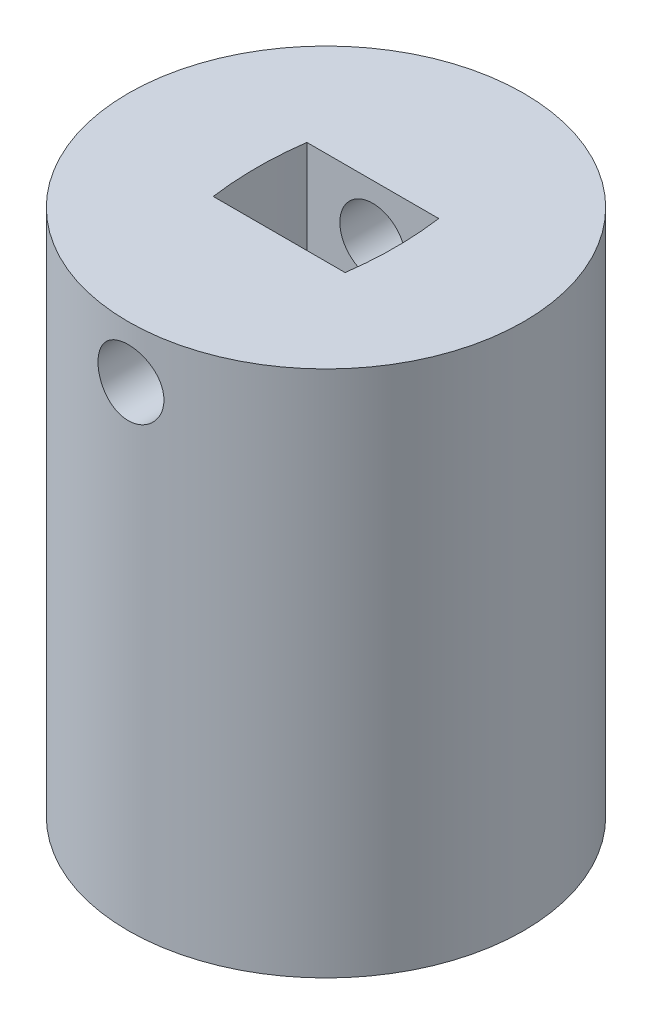
ISO-10303-21;
HEADER;
FILE_DESCRIPTION(('STEP AP214'),'2;1');
FILE_NAME('part.step','',(''),(''),'','','');
FILE_SCHEMA(('AUTOMOTIVE_DESIGN { 1 0 10303 214 1 1 1 1 }'));
ENDSEC;
DATA;
#1=APPLICATION_CONTEXT('core data for automotive mechanical design processes');
#2=APPLICATION_PROTOCOL_DEFINITION('international standard','automotive_design',2000,#1);
#3=PRODUCT_CONTEXT('',#1,'mechanical');
#4=PRODUCT('Part','Part','',(#3));
#5=PRODUCT_RELATED_PRODUCT_CATEGORY('part','',(#4));
#6=PRODUCT_DEFINITION_FORMATION('','',#4);
#7=PRODUCT_DEFINITION_CONTEXT('part definition',#1,'design');
#8=PRODUCT_DEFINITION('design','',#6,#7);
#9=PRODUCT_DEFINITION_SHAPE('','',#8);
#10=(LENGTH_UNIT() NAMED_UNIT(*) SI_UNIT(.MILLI.,.METRE.));
#11=(NAMED_UNIT(*) PLANE_ANGLE_UNIT() SI_UNIT($,.RADIAN.));
#12=(NAMED_UNIT(*) SI_UNIT($,.STERADIAN.) SOLID_ANGLE_UNIT());
#13=UNCERTAINTY_MEASURE_WITH_UNIT(LENGTH_MEASURE(1.E-05),#10,'distance_accuracy_value','');
#14=(GEOMETRIC_REPRESENTATION_CONTEXT(3) GLOBAL_UNCERTAINTY_ASSIGNED_CONTEXT((#13)) GLOBAL_UNIT_ASSIGNED_CONTEXT((#10,
#11,#12)) REPRESENTATION_CONTEXT('',''));
#15=CARTESIAN_POINT('',(0.,0.,0.));
#16=DIRECTION('',(0.,0.,1.));
#17=DIRECTION('',(1.,0.,0.));
#18=AXIS2_PLACEMENT_3D('',#15,#16,#17);
#19=CARTESIAN_POINT('',(0.,40.,0.));
#20=DIRECTION('',(0.,-1.,0.));
#21=DIRECTION('',(0.,0.,-1.));
#22=AXIS2_PLACEMENT_3D('',#19,#20,#21);
#23=CYLINDRICAL_SURFACE('',#22,15.);
#24=CARTESIAN_POINT('',(0.,33.5,15.));
#25=CARTESIAN_POINT('',(-0.139390904958215,33.5000055889478,14.9999976116882));
#26=CARTESIAN_POINT('',(-0.278857881838821,33.5116972749689,14.9980367791303));
#27=CARTESIAN_POINT('',(-0.553880221673043,33.5581356587653,14.9904034494139));
#28=CARTESIAN_POINT('',(-0.689431867959247,33.5929035569116,14.9847275392389));
#29=CARTESIAN_POINT('',(-0.952604747212645,33.6844154485928,14.9703006823645));
#30=CARTESIAN_POINT('',(-1.0802323684319,33.7411414656406,14.9615522515919));
#31=CARTESIAN_POINT('',(-1.32414184197795,33.8749122920524,14.9419422708207));
#32=CARTESIAN_POINT('',(-1.44042498987859,33.951954777483,14.9310809625443));
#33=CARTESIAN_POINT('',(-1.65947261429168,34.1249550838205,14.9083331745831));
#34=CARTESIAN_POINT('',(-1.76211290353497,34.2210691146361,14.8964387181486));
#35=CARTESIAN_POINT('',(-1.94988849865993,34.4291479684728,14.8730262687673));
#36=CARTESIAN_POINT('',(-2.03502269939097,34.5411137914566,14.8615082996267));
#37=CARTESIAN_POINT('',(-2.18586712560513,34.7785709661971,14.8400756575978));
#38=CARTESIAN_POINT('',(-2.251454552861,34.9041413368047,14.8301712909164));
#39=CARTESIAN_POINT('',(-2.36055836541122,35.1647095643006,14.8131978979467));
#40=CARTESIAN_POINT('',(-2.40407624156561,35.2997067836776,14.8061286801431));
#41=CARTESIAN_POINT('',(-2.46741437778481,35.5739802748565,14.7957053684276));
#42=CARTESIAN_POINT('',(-2.4874490291354,35.7132057365014,14.792317684857));
#43=CARTESIAN_POINT('',(-2.50391672528988,35.9930802768835,14.7895393893665));
#44=CARTESIAN_POINT('',(-2.500351440389,36.1337292541673,14.7901484945721));
#45=CARTESIAN_POINT('',(-2.46989509839615,36.4109278612754,14.7952642886356));
#46=CARTESIAN_POINT('',(-2.44324488188977,36.5475048035452,14.7997307331892));
#47=CARTESIAN_POINT('',(-2.36775314040345,36.8142213178291,14.8119949521101));
#48=CARTESIAN_POINT('',(-2.31891085431974,36.9443606688885,14.8197928407327));
#49=CARTESIAN_POINT('',(-2.20017724609391,37.1952288234409,14.837884793341));
#50=CARTESIAN_POINT('',(-2.13018591387971,37.3159094060812,14.8481906710733));
#51=CARTESIAN_POINT('',(-1.97121201755743,37.5439044005384,14.8701291841501));
#52=CARTESIAN_POINT('',(-1.88222792065429,37.6512177324549,14.8817619265429));
#53=CARTESIAN_POINT('',(-1.68648221215906,37.8508260858073,14.9052202787979));
#54=CARTESIAN_POINT('',(-1.57951396387313,37.9429185185401,14.9170464923165));
#55=CARTESIAN_POINT('',(-1.35153524898165,38.1078777626653,14.9394260139672));
#56=CARTESIAN_POINT('',(-1.23052469190643,38.1807444501832,14.9499793138975));
#57=CARTESIAN_POINT('',(-0.977705916166715,38.3052022271363,14.9686389289291));
#58=CARTESIAN_POINT('',(-0.845888725564665,38.3567754193312,14.9767431840745));
#59=CARTESIAN_POINT('',(-0.575298345602734,38.436994215246,14.9895750301266));
#60=CARTESIAN_POINT('',(-0.436525739179469,38.4656417369737,14.9943029035047));
#61=CARTESIAN_POINT('',(-0.157709901301624,38.4989213584611,14.9998112984269));
#62=CARTESIAN_POINT('',(-0.0177007371510119,38.5038315718056,15.0006375301278));
#63=CARTESIAN_POINT('',(0.261139772889887,38.4902386555719,14.9983747442117));
#64=CARTESIAN_POINT('',(0.399971163892038,38.4717364268663,14.9952858772412));
#65=CARTESIAN_POINT('',(0.671656175546763,38.4120751506645,14.985568269382));
#66=CARTESIAN_POINT('',(0.804540868385378,38.3710537916099,14.9789610480131));
#67=CARTESIAN_POINT('',(1.06154688486044,38.2676654818005,14.9629446445536));
#68=CARTESIAN_POINT('',(1.18566771590972,38.2052973323647,14.9535353051202));
#69=CARTESIAN_POINT('',(1.42283068946896,38.0603488753032,14.9328451630241));
#70=CARTESIAN_POINT('',(1.53576525093715,37.9775948438327,14.9215485588702));
#71=CARTESIAN_POINT('',(1.74624358550269,37.7944626846149,14.898384673919));
#72=CARTESIAN_POINT('',(1.84378623969658,37.6940832767233,14.8865173517155));
#73=CARTESIAN_POINT('',(2.021742779658,37.4773024519286,14.8634017523585));
#74=CARTESIAN_POINT('',(2.10196876111371,37.3607458344856,14.8521611613711));
#75=CARTESIAN_POINT('',(2.24170231029498,37.1156470308615,14.8317152977788));
#76=CARTESIAN_POINT('',(2.30121053476982,36.9871052247725,14.8225099606602));
#77=CARTESIAN_POINT('',(2.39753833147315,36.7222102671879,14.807234536977));
#78=CARTESIAN_POINT('',(2.43445143254795,36.5858919049695,14.8011515431106));
#79=CARTESIAN_POINT('',(2.48483545377828,36.3088798707782,14.7927771683526));
#80=CARTESIAN_POINT('',(2.49830841194617,36.1681865802679,14.7904854578272));
#81=CARTESIAN_POINT('',(2.50137286604735,35.8882948340376,14.7899673308401));
#82=CARTESIAN_POINT('',(2.49126013612519,35.7490996214247,14.7916905650565));
#83=CARTESIAN_POINT('',(2.44807983895685,35.4744207519492,14.7988978145373));
#84=CARTESIAN_POINT('',(2.41501234611248,35.3389370830581,14.8043818176121));
#85=CARTESIAN_POINT('',(2.3269744895949,35.0756415627074,14.8184735628172));
#86=CARTESIAN_POINT('',(2.27202959060044,34.947820989944,14.8270776721967));
#87=CARTESIAN_POINT('',(2.14182700391591,34.7031643308052,14.8464436892221));
#88=CARTESIAN_POINT('',(2.06656830874856,34.5863287896279,14.857205703884));
#89=CARTESIAN_POINT('',(1.89681888437215,34.3654644168922,14.8798345404562));
#90=CARTESIAN_POINT('',(1.80211056359364,34.2616039832997,14.891712955763));
#91=CARTESIAN_POINT('',(1.59660903138023,34.0711483955251,14.9151437236084));
#92=CARTESIAN_POINT('',(1.48581211291264,33.9845572313618,14.9266960002655));
#93=CARTESIAN_POINT('',(1.25036916964028,33.8305517318,14.9482652964222));
#94=CARTESIAN_POINT('',(1.12563278753282,33.763273960687,14.958271162531));
#95=CARTESIAN_POINT('',(0.866513069378985,33.6507305153901,14.9755116760178));
#96=CARTESIAN_POINT('',(0.732139494830013,33.6054429189203,14.9827490817748));
#97=CARTESIAN_POINT('',(0.497703310045404,33.5479947258733,14.9920579083296));
#98=CARTESIAN_POINT('',(0.39905883029845,33.530025530384,14.9950202727336));
#99=CARTESIAN_POINT('',(0.200289310319811,33.5060262621552,14.9989921598612));
#100=CARTESIAN_POINT('',(0.100164295608495,33.4999959838626,15.0000017162064));
#101=CARTESIAN_POINT('',(0.,33.5,15.));
#102=B_SPLINE_CURVE_WITH_KNOTS('',3,(#24,#25,#26,#27,#28,#29,#30,#31,#32,#33,#34,#35,#36,#37,
#38,#39,#40,#41,#42,#43,#44,#45,#46,#47,#48,#49,#50,#51,#52,#53,#54,#55,#56,#57,#58,#59,#60,#61,
#62,#63,#64,#65,#66,#67,#68,#69,#70,#71,#72,#73,#74,#75,#76,#77,#78,#79,#80,#81,#82,#83,#84,#85,
#86,#87,#88,#89,#90,#91,#92,#93,#94,#95,#96,#97,#98,#99,#100,#101),.UNSPECIFIED.,.T.,.F.,(4,2,2,
2,2,2,2,2,2,2,2,2,2,2,2,2,2,2,2,2,2,2,2,2,2,2,2,2,2,2,2,2,2,2,2,2,2,2,4),(0.,0.417806584938509,
0.835997545695421,1.25384686702527,1.67164841267479,2.09302491062332,2.51442800169857,
2.9384252082384,3.36239376876182,3.78246077103424,4.20249804320887,4.61820521760409,
5.03392665025381,5.45164556632558,5.86939820680574,6.29232769911327,6.71525991635847,
7.13854688915903,7.56179844521149,7.98007883491397,8.3983431303586,8.81407807006416,
9.22983635826067,9.64926825627024,10.0687306305428,10.4925382200762,10.9163323737594,
11.3383602234177,11.7603513778662,12.177079095227,12.5938054618813,13.0100481822622,
13.4263115502934,13.8475138419339,14.2688133387897,14.693022316072,15.1168075213007,
15.4170424816402,15.7172722727697),.UNSPECIFIED.);
#103=CARTESIAN_POINT('',(0.,33.5,15.));
#104=VERTEX_POINT('',#103);
#105=EDGE_CURVE('E202',#104,#104,#102,.T.);
#106=ORIENTED_EDGE('',*,*,#105,.T.);
#107=EDGE_LOOP('',(#106));
#108=FACE_BOUND('',#107,.T.);
#109=CARTESIAN_POINT('',(0.,38.5,-15.));
#110=CARTESIAN_POINT('',(-0.139390904958215,38.4999944110522,-14.9999976116882));
#111=CARTESIAN_POINT('',(-0.278857881838821,38.4883027250311,-14.9980367791303));
#112=CARTESIAN_POINT('',(-0.553880221673043,38.4418643412347,-14.9904034494139));
#113=CARTESIAN_POINT('',(-0.689431867959247,38.4070964430884,-14.9847275392389));
#114=CARTESIAN_POINT('',(-0.952604747212645,38.3155845514072,-14.9703006823645));
#115=CARTESIAN_POINT('',(-1.0802323684319,38.2588585343594,-14.9615522515919));
#116=CARTESIAN_POINT('',(-1.32414184197795,38.1250877079476,-14.9419422708207));
#117=CARTESIAN_POINT('',(-1.44042498987859,38.048045222517,-14.9310809625443));
#118=CARTESIAN_POINT('',(-1.65947261429168,37.8750449161795,-14.9083331745831));
#119=CARTESIAN_POINT('',(-1.76211290353497,37.7789308853639,-14.8964387181486));
#120=CARTESIAN_POINT('',(-1.94988849865993,37.5708520315272,-14.8730262687673));
#121=CARTESIAN_POINT('',(-2.03502269939097,37.4588862085434,-14.8615082996267));
#122=CARTESIAN_POINT('',(-2.18586712560513,37.2214290338029,-14.8400756575978));
#123=CARTESIAN_POINT('',(-2.251454552861,37.0958586631952,-14.8301712909164));
#124=CARTESIAN_POINT('',(-2.36055836541122,36.8352904356994,-14.8131978979467));
#125=CARTESIAN_POINT('',(-2.40407624156561,36.7002932163224,-14.8061286801431));
#126=CARTESIAN_POINT('',(-2.46741437778481,36.4260197251435,-14.7957053684276));
#127=CARTESIAN_POINT('',(-2.4874490291354,36.2867942634986,-14.792317684857));
#128=CARTESIAN_POINT('',(-2.50391672528988,36.0069197231165,-14.7895393893665));
#129=CARTESIAN_POINT('',(-2.500351440389,35.8662707458327,-14.7901484945721));
#130=CARTESIAN_POINT('',(-2.46989509839615,35.5890721387246,-14.7952642886356));
#131=CARTESIAN_POINT('',(-2.44324488188977,35.4524951964548,-14.7997307331892));
#132=CARTESIAN_POINT('',(-2.36775314040345,35.1857786821709,-14.8119949521101));
#133=CARTESIAN_POINT('',(-2.31891085431974,35.0556393311115,-14.8197928407327));
#134=CARTESIAN_POINT('',(-2.20017724609391,34.8047711765591,-14.837884793341));
#135=CARTESIAN_POINT('',(-2.13018591387971,34.6840905939188,-14.8481906710733));
#136=CARTESIAN_POINT('',(-1.97121201755743,34.4560955994616,-14.8701291841501));
#137=CARTESIAN_POINT('',(-1.88222792065429,34.3487822675451,-14.8817619265429));
#138=CARTESIAN_POINT('',(-1.68648221215906,34.1491739141927,-14.9052202787979));
#139=CARTESIAN_POINT('',(-1.57951396387313,34.0570814814599,-14.9170464923165));
#140=CARTESIAN_POINT('',(-1.35153524898165,33.8921222373347,-14.9394260139672));
#141=CARTESIAN_POINT('',(-1.23052469190643,33.8192555498168,-14.9499793138975));
#142=CARTESIAN_POINT('',(-0.977705916166715,33.6947977728637,-14.9686389289291));
#143=CARTESIAN_POINT('',(-0.845888725564665,33.6432245806687,-14.9767431840745));
#144=CARTESIAN_POINT('',(-0.575298345602734,33.563005784754,-14.9895750301266));
#145=CARTESIAN_POINT('',(-0.436525739179469,33.5343582630263,-14.9943029035047));
#146=CARTESIAN_POINT('',(-0.157709901301624,33.5010786415389,-14.9998112984269));
#147=CARTESIAN_POINT('',(-0.0177007371510124,33.4961684281944,-15.0006375301278));
#148=CARTESIAN_POINT('',(0.261139772889886,33.5097613444281,-14.9983747442117));
#149=CARTESIAN_POINT('',(0.399971163892038,33.5282635731337,-14.9952858772412));
#150=CARTESIAN_POINT('',(0.671656175546763,33.5879248493355,-14.985568269382));
#151=CARTESIAN_POINT('',(0.804540868385378,33.6289462083901,-14.9789610480131));
#152=CARTESIAN_POINT('',(1.06154688486044,33.7323345181995,-14.9629446445536));
#153=CARTESIAN_POINT('',(1.18566771590972,33.7947026676353,-14.9535353051202));
#154=CARTESIAN_POINT('',(1.42283068946896,33.9396511246968,-14.9328451630241));
#155=CARTESIAN_POINT('',(1.53576525093715,34.0224051561673,-14.9215485588702));
#156=CARTESIAN_POINT('',(1.74624358550269,34.2055373153851,-14.898384673919));
#157=CARTESIAN_POINT('',(1.84378623969658,34.3059167232767,-14.8865173517155));
#158=CARTESIAN_POINT('',(2.021742779658,34.5226975480714,-14.8634017523585));
#159=CARTESIAN_POINT('',(2.10196876111371,34.6392541655144,-14.8521611613711));
#160=CARTESIAN_POINT('',(2.24170231029499,34.8843529691385,-14.8317152977788));
#161=CARTESIAN_POINT('',(2.30121053476982,35.0128947752275,-14.8225099606602));
#162=CARTESIAN_POINT('',(2.39753833147315,35.2777897328121,-14.807234536977));
#163=CARTESIAN_POINT('',(2.43445143254795,35.4141080950305,-14.8011515431106));
#164=CARTESIAN_POINT('',(2.48483545377828,35.6911201292218,-14.7927771683526));
#165=CARTESIAN_POINT('',(2.49830841194617,35.8318134197321,-14.7904854578272));
#166=CARTESIAN_POINT('',(2.50137286604735,36.1117051659624,-14.7899673308401));
#167=CARTESIAN_POINT('',(2.49126013612519,36.2509003785753,-14.7916905650565));
#168=CARTESIAN_POINT('',(2.44807983895685,36.5255792480508,-14.7988978145373));
#169=CARTESIAN_POINT('',(2.41501234611248,36.6610629169419,-14.8043818176121));
#170=CARTESIAN_POINT('',(2.3269744895949,36.9243584372926,-14.8184735628172));
#171=CARTESIAN_POINT('',(2.27202959060044,37.052179010056,-14.8270776721967));
#172=CARTESIAN_POINT('',(2.1418270039159,37.2968356691949,-14.8464436892221));
#173=CARTESIAN_POINT('',(2.06656830874856,37.4136712103721,-14.857205703884));
#174=CARTESIAN_POINT('',(1.89681888437215,37.6345355831078,-14.8798345404562));
#175=CARTESIAN_POINT('',(1.80211056359365,37.7383960167003,-14.891712955763));
#176=CARTESIAN_POINT('',(1.59660903138023,37.9288516044749,-14.9151437236084));
#177=CARTESIAN_POINT('',(1.48581211291264,38.0154427686382,-14.9266960002655));
#178=CARTESIAN_POINT('',(1.25036916964028,38.1694482681999,-14.9482652964222));
#179=CARTESIAN_POINT('',(1.12563278753282,38.236726039313,-14.958271162531));
#180=CARTESIAN_POINT('',(0.866513069378985,38.3492694846099,-14.9755116760178));
#181=CARTESIAN_POINT('',(0.732139494830013,38.3945570810797,-14.9827490817748));
#182=CARTESIAN_POINT('',(0.497703310045404,38.4520052741267,-14.9920579083296));
#183=CARTESIAN_POINT('',(0.39905883029845,38.469974469616,-14.9950202727336));
#184=CARTESIAN_POINT('',(0.200289310319811,38.4939737378448,-14.9989921598612));
#185=CARTESIAN_POINT('',(0.100164295608495,38.5000040161374,-15.0000017162064));
#186=CARTESIAN_POINT('',(0.,38.5,-15.));
#187=B_SPLINE_CURVE_WITH_KNOTS('',3,(#109,#110,#111,#112,#113,#114,#115,#116,#117,#118,#119,
#120,#121,#122,#123,#124,#125,#126,#127,#128,#129,#130,#131,#132,#133,#134,#135,#136,#137,#138,
#139,#140,#141,#142,#143,#144,#145,#146,#147,#148,#149,#150,#151,#152,#153,#154,#155,#156,#157,
#158,#159,#160,#161,#162,#163,#164,#165,#166,#167,#168,#169,#170,#171,#172,#173,#174,#175,#176,
#177,#178,#179,#180,#181,#182,#183,#184,#185,#186),.UNSPECIFIED.,.T.,.F.,(4,2,2,2,2,2,2,2,2,2,2,
2,2,2,2,2,2,2,2,2,2,2,2,2,2,2,2,2,2,2,2,2,2,2,2,2,2,2,4),(0.,0.417806584938509,
0.835997545695421,1.25384686702527,1.67164841267479,2.09302491062332,2.51442800169857,
2.9384252082384,3.36239376876182,3.78246077103424,4.20249804320887,4.61820521760409,
5.03392665025381,5.45164556632558,5.86939820680574,6.29232769911327,6.71525991635847,
7.13854688915903,7.56179844521149,7.98007883491397,8.3983431303586,8.81407807006416,
9.22983635826067,9.64926825627025,10.0687306305428,10.4925382200762,10.9163323737594,
11.3383602234177,11.7603513778662,12.177079095227,12.5938054618813,13.0100481822622,
13.4263115502934,13.8475138419339,14.2688133387897,14.693022316072,15.1168075213007,
15.4170424816402,15.7172722727697),.UNSPECIFIED.);
#188=CARTESIAN_POINT('',(0.,38.5,-15.));
#189=VERTEX_POINT('',#188);
#190=EDGE_CURVE('E133',#189,#189,#187,.T.);
#191=ORIENTED_EDGE('',*,*,#190,.T.);
#192=EDGE_LOOP('',(#191));
#193=FACE_BOUND('',#192,.T.);
#194=CARTESIAN_POINT('',(0.,14.0042345229517,-15.));
#195=CARTESIAN_POINT('',(-0.111808835669284,14.0042298132447,-14.9999983574254));
#196=CARTESIAN_POINT('',(-0.22368597927628,13.9948269849892,-14.9987367072719));
#197=CARTESIAN_POINT('',(-0.444322725138079,13.9574681739021,-14.993825111269));
#198=CARTESIAN_POINT('',(-0.553079022333037,13.9294932280545,-14.9901727244172));
#199=CARTESIAN_POINT('',(-0.764248312626984,13.8558328054102,-14.9808907984907));
#200=CARTESIAN_POINT('',(-0.866665683058494,13.8101597119132,-14.9752626421097));
#201=CARTESIAN_POINT('',(-1.0623638950303,13.7024276091454,-14.9626538666039));
#202=CARTESIAN_POINT('',(-1.15564620633703,13.6403712417852,-14.9556734655857));
#203=CARTESIAN_POINT('',(-1.33102582250468,13.5012212613475,-14.9410899478996));
#204=CARTESIAN_POINT('',(-1.41305798549586,13.4240458779432,-14.9334835816211));
#205=CARTESIAN_POINT('',(-1.56304735673102,13.257024333875,-14.9185313755795));
#206=CARTESIAN_POINT('',(-1.63100381997221,13.1671775029558,-14.9111855496234));
#207=CARTESIAN_POINT('',(-1.75115902268907,12.9769354000066,-14.8975543544019));
#208=CARTESIAN_POINT('',(-1.80329607482578,12.876500840473,-14.8912731776576));
#209=CARTESIAN_POINT('',(-1.8899384500729,12.6682034557149,-14.8805258737923));
#210=CARTESIAN_POINT('',(-1.92444453245278,12.5603409505983,-14.8760596685121));
#211=CARTESIAN_POINT('',(-1.97464606772174,12.34092871245,-14.8694793656867));
#212=CARTESIAN_POINT('',(-1.99045204228506,12.2294046884187,-14.8673514537014));
#213=CARTESIAN_POINT('',(-2.00314680548117,12.0052683433457,-14.8656465160931));
#214=CARTESIAN_POINT('',(-2.00003645633601,11.8926560721408,-14.866069374204));
#215=CARTESIAN_POINT('',(-1.97507745939234,11.6703133929237,-14.8694055577299));
#216=CARTESIAN_POINT('',(-1.95335097531762,11.560568993066,-14.8723026462234));
#217=CARTESIAN_POINT('',(-1.89196724634371,11.3462976861916,-14.8802355277475));
#218=CARTESIAN_POINT('',(-1.85230959261457,11.2417708981966,-14.8852713695413));
#219=CARTESIAN_POINT('',(-1.75605929143191,11.0405248882445,-14.8969326111103));
#220=CARTESIAN_POINT('',(-1.69941397913749,10.9438311517574,-14.903562941239));
#221=CARTESIAN_POINT('',(-1.57083393344289,10.761275441034,-14.9176623621993));
#222=CARTESIAN_POINT('',(-1.49889840502385,10.6754140303975,-14.9251314966353));
#223=CARTESIAN_POINT('',(-1.34110490026362,10.5162515103698,-14.9401389923359));
#224=CARTESIAN_POINT('',(-1.25514170702644,10.4430546802493,-14.947677435412));
#225=CARTESIAN_POINT('',(-1.07209417013341,10.3121124780233,-14.9619192381826));
#226=CARTESIAN_POINT('',(-0.975009794442369,10.2543671504281,-14.9686225954715));
#227=CARTESIAN_POINT('',(-0.772392219730469,10.1559654052569,-14.9804439374358));
#228=CARTESIAN_POINT('',(-0.66685557884123,10.1153159919053,-14.9855612720896));
#229=CARTESIAN_POINT('',(-0.450370924336249,10.0523452039793,-14.9936282590407));
#230=CARTESIAN_POINT('',(-0.339423199542257,10.0300228523123,-14.9965780268993));
#231=CARTESIAN_POINT('',(-0.116166903325644,10.0044760901805,-14.9999624137686));
#232=CARTESIAN_POINT('',(-0.00387503454704253,10.0011081211682,-15.0004159384905));
#233=CARTESIAN_POINT('',(0.219671617218718,10.0131861870788,-14.9988079153852));
#234=CARTESIAN_POINT('',(0.330926425345664,10.028631764734,-14.996746428686));
#235=CARTESIAN_POINT('',(0.548813715572938,10.0777791763356,-14.990351753581));
#236=CARTESIAN_POINT('',(0.655462016512045,10.1114120912738,-14.9860271430292));
#237=CARTESIAN_POINT('',(0.86160509879356,10.1959074888887,-14.9755900925429));
#238=CARTESIAN_POINT('',(0.961099607015638,10.2467706289649,-14.9694775843944));
#239=CARTESIAN_POINT('',(1.15074887861608,10.364626678535,-14.9560983737007));
#240=CARTESIAN_POINT('',(1.2408458143966,10.431711888665,-14.9488251504572));
#241=CARTESIAN_POINT('',(1.4085529469919,10.5799778521759,-14.9339572870998));
#242=CARTESIAN_POINT('',(1.48616257662379,10.6611592454681,-14.9263626324062));
#243=CARTESIAN_POINT('',(1.62720549423098,10.8359476655912,-14.9116490247351));
#244=CARTESIAN_POINT('',(1.69054327608938,10.9296320896898,-14.904533487753));
#245=CARTESIAN_POINT('',(1.80058351078814,11.1263939332326,-14.8916413300182));
#246=CARTESIAN_POINT('',(1.84728633510347,11.229471142862,-14.8858646793678));
#247=CARTESIAN_POINT('',(1.92257836500746,11.4417917649794,-14.8763281178008));
#248=CARTESIAN_POINT('',(1.95122028846795,11.5510162081625,-14.872562342326));
#249=CARTESIAN_POINT('',(1.98974667143959,11.7727781550804,-14.8674574869829));
#250=CARTESIAN_POINT('',(1.99963213426782,11.8853154812761,-14.8661182773134));
#251=CARTESIAN_POINT('',(2.00034485806189,12.1095580138052,-14.8660223129545));
#252=CARTESIAN_POINT('',(1.99132219194493,12.2212627639159,-14.8672452228252));
#253=CARTESIAN_POINT('',(1.95479376686689,12.4415523980555,-14.872091838742));
#254=CARTESIAN_POINT('',(1.92728801483269,12.5501372832536,-14.8757155438883));
#255=CARTESIAN_POINT('',(1.85462310332207,12.7610782062032,-14.8849489027276));
#256=CARTESIAN_POINT('',(1.80947220819041,12.8634371340685,-14.890557626594));
#257=CARTESIAN_POINT('',(1.70281342759737,13.0591504067777,-14.9031304571282));
#258=CARTESIAN_POINT('',(1.64130522630429,13.1525045777077,-14.910094589966));
#259=CARTESIAN_POINT('',(1.50312448509508,13.3283241728801,-14.9246596718306));
#260=CARTESIAN_POINT('',(1.42634027226901,13.4107014707068,-14.9322650575408));
#261=CARTESIAN_POINT('',(1.26002169349824,13.5614577393132,-14.9472171900166));
#262=CARTESIAN_POINT('',(1.17048434072978,13.6298334217019,-14.9545638756898));
#263=CARTESIAN_POINT('',(0.980752987852822,13.7509016614182,-14.9682063513753));
#264=CARTESIAN_POINT('',(0.880514620743965,13.8035251895069,-14.9744974642689));
#265=CARTESIAN_POINT('',(0.672592409587328,13.8911151214967,-14.9852732065897));
#266=CARTESIAN_POINT('',(0.564916678969889,13.9261004315765,-14.9897597692431));
#267=CARTESIAN_POINT('',(0.380588408098418,13.9691825293368,-14.9953572174327));
#268=CARTESIAN_POINT('',(0.305091081955779,13.9823077664753,-14.9970896363507));
#269=CARTESIAN_POINT('',(0.153073171616112,13.9998353371171,-14.9994115849077));
#270=CARTESIAN_POINT('',(0.0765525964512404,14.0042377475653,-15.000001124628));
#271=CARTESIAN_POINT('',(0.,14.0042345229517,-15.));
#272=B_SPLINE_CURVE_WITH_KNOTS('',3,(#194,#195,#196,#197,#198,#199,#200,#201,#202,#203,#204,
#205,#206,#207,#208,#209,#210,#211,#212,#213,#214,#215,#216,#217,#218,#219,#220,#221,#222,#223,
#224,#225,#226,#227,#228,#229,#230,#231,#232,#233,#234,#235,#236,#237,#238,#239,#240,#241,#242,
#243,#244,#245,#246,#247,#248,#249,#250,#251,#252,#253,#254,#255,#256,#257,#258,#259,#260,#261,
#262,#263,#264,#265,#266,#267,#268,#269,#270,#271),.UNSPECIFIED.,.T.,.F.,(4,2,2,2,2,2,2,2,2,2,2,
2,2,2,2,2,2,2,2,2,2,2,2,2,2,2,2,2,2,2,2,2,2,2,2,2,2,2,4),(0.,0.335146851305743,
0.670636430885045,1.00589169282741,1.34109292564035,1.67815978443559,2.01524447904836,
2.35362721511648,2.69199537766205,3.02835355914359,3.3646964092492,3.69884885098044,
4.0330089117585,4.36821583137897,4.70344018443797,5.0413054448485,5.37917167852296,
5.71717620202539,6.05516270391743,6.39058584992061,6.72600084354478,7.06015363396463,
7.39431917503546,7.73043274769884,8.06656158258761,8.4048770453545,8.74318495273048,
9.08050074735454,9.41779849783634,9.75242927496624,10.0870599266874,10.4215340370262,
10.756014605959,11.0930366783511,11.4301378125116,11.7686952667451,12.1068890499242,
12.3363573904731,12.5658237068544),.UNSPECIFIED.);
#273=CARTESIAN_POINT('',(0.,14.0042345229517,-15.));
#274=VERTEX_POINT('',#273);
#275=EDGE_CURVE('E157',#274,#274,#272,.T.);
#276=ORIENTED_EDGE('',*,*,#275,.T.);
#277=EDGE_LOOP('',(#276));
#278=FACE_BOUND('',#277,.T.);
#279=CARTESIAN_POINT('',(0.,40.,0.));
#280=DIRECTION('',(0.,1.,0.));
#281=DIRECTION('',(0.,0.,1.));
#282=AXIS2_PLACEMENT_3D('',#279,#280,#281);
#283=CIRCLE('',#282,15.);
#284=CARTESIAN_POINT('',(0.,40.,15.));
#285=VERTEX_POINT('',#284);
#286=EDGE_CURVE('E11',#285,#285,#283,.T.);
#287=ORIENTED_EDGE('',*,*,#286,.F.);
#288=EDGE_LOOP('',(#287));
#289=FACE_BOUND('',#288,.T.);
#290=CARTESIAN_POINT('',(0.,0.,0.));
#291=DIRECTION('',(0.,1.,0.));
#292=DIRECTION('',(0.,0.,1.));
#293=AXIS2_PLACEMENT_3D('',#290,#291,#292);
#294=CIRCLE('',#293,15.);
#295=CARTESIAN_POINT('',(0.,0.,15.));
#296=VERTEX_POINT('',#295);
#297=EDGE_CURVE('E46',#296,#296,#294,.T.);
#298=ORIENTED_EDGE('',*,*,#297,.T.);
#299=EDGE_LOOP('',(#298));
#300=FACE_BOUND('',#299,.T.);
#301=ADVANCED_FACE('F37',(#108,#193,#278,#289,#300),#23,.T.);
#302=CARTESIAN_POINT('',(0.,40.,0.));
#303=DIRECTION('',(0.,1.,0.));
#304=DIRECTION('',(0.,0.,1.));
#305=AXIS2_PLACEMENT_3D('',#302,#303,#304);
#306=PLANE('',#305);
#307=CARTESIAN_POINT('',(-5.,40.,-3.55));
#308=CARTESIAN_POINT('',(-5.49162040195258,40.,0.));
#309=CARTESIAN_POINT('',(-5.,40.,3.55));
#310=B_SPLINE_CURVE_WITH_KNOTS('',2,(#307,#308,#309),.UNSPECIFIED.,.F.,.F.,(3,3),(0.,1.),.UNSPECIFIED.);
#311=CARTESIAN_POINT('',(-5.,40.,-3.55));
#312=VERTEX_POINT('',#311);
#313=CARTESIAN_POINT('',(-5.,40.,3.55));
#314=VERTEX_POINT('',#313);
#315=EDGE_CURVE('E54',#312,#314,#310,.T.);
#316=ORIENTED_EDGE('',*,*,#315,.F.);
#317=DIRECTION('',(-1.,0.,0.));
#318=VECTOR('',#317,1.);
#319=CARTESIAN_POINT('',(-5.,40.,-3.55));
#320=LINE('',#319,#318);
#321=CARTESIAN_POINT('',(5.,40.,-3.55));
#322=VERTEX_POINT('',#321);
#323=EDGE_CURVE('E124',#322,#312,#320,.T.);
#324=ORIENTED_EDGE('',*,*,#323,.F.);
#325=CARTESIAN_POINT('',(5.,40.,3.55));
#326=CARTESIAN_POINT('',(5.49162040195259,40.,0.));
#327=CARTESIAN_POINT('',(5.,40.,-3.55));
#328=B_SPLINE_CURVE_WITH_KNOTS('',2,(#325,#326,#327),.UNSPECIFIED.,.F.,.F.,(3,3),(0.,1.),.UNSPECIFIED.);
#329=CARTESIAN_POINT('',(5.,40.,3.55));
#330=VERTEX_POINT('',#329);
#331=EDGE_CURVE('E127',#330,#322,#328,.T.);
#332=ORIENTED_EDGE('',*,*,#331,.F.);
#333=DIRECTION('',(1.,0.,0.));
#334=VECTOR('',#333,1.);
#335=CARTESIAN_POINT('',(-5.,40.,3.55));
#336=LINE('',#335,#334);
#337=EDGE_CURVE('E286',#314,#330,#336,.T.);
#338=ORIENTED_EDGE('',*,*,#337,.F.);
#339=EDGE_LOOP('',(#316,#324,#332,#338));
#340=FACE_BOUND('',#339,.T.);
#341=ORIENTED_EDGE('',*,*,#286,.T.);
#342=EDGE_LOOP('',(#341));
#343=FACE_BOUND('',#342,.T.);
#344=ADVANCED_FACE('F186',(#340,#343),#306,.T.);
#345=CARTESIAN_POINT('',(0.,0.,0.));
#346=DIRECTION('',(0.,1.,0.));
#347=DIRECTION('',(0.,0.,1.));
#348=AXIS2_PLACEMENT_3D('',#345,#346,#347);
#349=PLANE('',#348);
#350=DIRECTION('',(1.,0.,0.));
#351=VECTOR('',#350,1.);
#352=CARTESIAN_POINT('',(-4.00000293248482,0.,-5.));
#353=LINE('',#352,#351);
#354=CARTESIAN_POINT('',(-4.00000293248482,0.,-5.));
#355=VERTEX_POINT('',#354);
#356=CARTESIAN_POINT('',(3.99999706751518,0.,-5.));
#357=VERTEX_POINT('',#356);
#358=EDGE_CURVE('E229',#355,#357,#353,.T.);
#359=ORIENTED_EDGE('',*,*,#358,.F.);
#360=CARTESIAN_POINT('',(-4.00000293248482,0.,5.));
#361=CARTESIAN_POINT('',(-8.19998214769428,0.,-0.00561633959382891));
#362=CARTESIAN_POINT('',(-4.00000293248482,0.,-5.));
#363=B_SPLINE_CURVE_WITH_KNOTS('',2,(#360,#361,#362),.UNSPECIFIED.,.F.,.F.,(3,3),(0.,1.),.UNSPECIFIED.);
#364=CARTESIAN_POINT('',(-4.00000293248482,0.,5.));
#365=VERTEX_POINT('',#364);
#366=EDGE_CURVE('E62',#365,#355,#363,.T.);
#367=ORIENTED_EDGE('',*,*,#366,.F.);
#368=DIRECTION('',(-1.,0.,0.));
#369=VECTOR('',#368,1.);
#370=CARTESIAN_POINT('',(-4.00000293248482,0.,5.));
#371=LINE('',#370,#369);
#372=CARTESIAN_POINT('',(3.99999706751518,0.,5.));
#373=VERTEX_POINT('',#372);
#374=EDGE_CURVE('E172',#373,#365,#371,.T.);
#375=ORIENTED_EDGE('',*,*,#374,.F.);
#376=CARTESIAN_POINT('',(3.99999706751518,0.,-5.));
#377=CARTESIAN_POINT('',(8.1999744968867,0.,0.00924930082589396));
#378=CARTESIAN_POINT('',(3.99999706751518,0.,5.));
#379=B_SPLINE_CURVE_WITH_KNOTS('',2,(#376,#377,#378),.UNSPECIFIED.,.F.,.F.,(3,3),(0.,1.),.UNSPECIFIED.);
#380=EDGE_CURVE('E224',#357,#373,#379,.T.);
#381=ORIENTED_EDGE('',*,*,#380,.F.);
#382=EDGE_LOOP('',(#359,#367,#375,#381));
#383=FACE_BOUND('',#382,.T.);
#384=ORIENTED_EDGE('',*,*,#297,.F.);
#385=EDGE_LOOP('',(#384));
#386=FACE_BOUND('',#385,.T.);
#387=ADVANCED_FACE('F183',(#383,#386),#349,.F.);
#388=CARTESIAN_POINT('',(-4.00000293248482,15.,5.));
#389=CARTESIAN_POINT('',(-8.19998214769428,15.,-0.00561633959382891));
#390=CARTESIAN_POINT('',(-4.00000293248482,15.,-5.));
#391=B_SPLINE_CURVE_WITH_KNOTS('',2,(#388,#389,#390),.UNSPECIFIED.,.F.,.F.,(3,3),(0.,1.),.UNSPECIFIED.);
#392=DIRECTION('',(0.,-1.,0.));
#393=VECTOR('',#392,1.);
#394=SURFACE_OF_LINEAR_EXTRUSION('',#391,#393);
#395=ORIENTED_EDGE('',*,*,#366,.T.);
#396=DIRECTION('',(0.,-1.,0.));
#397=VECTOR('',#396,1.);
#398=CARTESIAN_POINT('',(-4.00000293248482,15.,-5.));
#399=LINE('',#398,#397);
#400=CARTESIAN_POINT('',(-4.00000293248482,15.,-5.));
#401=VERTEX_POINT('',#400);
#402=EDGE_CURVE('E216',#401,#355,#399,.T.);
#403=ORIENTED_EDGE('',*,*,#402,.F.);
#404=CARTESIAN_POINT('',(-4.00000293248482,15.,5.));
#405=VERTEX_POINT('',#404);
#406=EDGE_CURVE('E165',#405,#401,#391,.T.);
#407=ORIENTED_EDGE('',*,*,#406,.F.);
#408=DIRECTION('',(0.,-1.,0.));
#409=VECTOR('',#408,1.);
#410=CARTESIAN_POINT('',(-4.00000293248482,15.,5.));
#411=LINE('',#410,#409);
#412=EDGE_CURVE('E212',#405,#365,#411,.T.);
#413=ORIENTED_EDGE('',*,*,#412,.T.);
#414=EDGE_LOOP('',(#395,#403,#407,#413));
#415=FACE_BOUND('',#414,.T.);
#416=ADVANCED_FACE('F178',(#415),#394,.F.);
#417=CARTESIAN_POINT('',(-4.00000293248482,15.,5.));
#418=DIRECTION('',(0.,0.,1.));
#419=DIRECTION('',(1.,0.,0.));
#420=AXIS2_PLACEMENT_3D('',#417,#418,#419);
#421=PLANE('',#420);
#422=ORIENTED_EDGE('',*,*,#374,.T.);
#423=ORIENTED_EDGE('',*,*,#412,.F.);
#424=DIRECTION('',(-1.,0.,0.));
#425=VECTOR('',#424,1.);
#426=CARTESIAN_POINT('',(-4.00000293248482,15.,5.));
#427=LINE('',#426,#425);
#428=CARTESIAN_POINT('',(3.99999706751518,15.,5.));
#429=VERTEX_POINT('',#428);
#430=EDGE_CURVE('E219',#429,#405,#427,.T.);
#431=ORIENTED_EDGE('',*,*,#430,.F.);
#432=DIRECTION('',(0.,-1.,0.));
#433=VECTOR('',#432,1.);
#434=CARTESIAN_POINT('',(3.99999706751518,15.,5.));
#435=LINE('',#434,#433);
#436=EDGE_CURVE('E213',#429,#373,#435,.T.);
#437=ORIENTED_EDGE('',*,*,#436,.T.);
#438=EDGE_LOOP('',(#422,#423,#431,#437));
#439=FACE_BOUND('',#438,.T.);
#440=ADVANCED_FACE('F182',(#439),#421,.F.);
#441=CARTESIAN_POINT('',(3.99999706751518,15.,-5.));
#442=CARTESIAN_POINT('',(8.1999744968867,15.,0.00924930082589396));
#443=CARTESIAN_POINT('',(3.99999706751518,15.,5.));
#444=B_SPLINE_CURVE_WITH_KNOTS('',2,(#441,#442,#443),.UNSPECIFIED.,.F.,.F.,(3,3),(0.,1.),.UNSPECIFIED.);
#445=DIRECTION('',(0.,-1.,0.));
#446=VECTOR('',#445,1.);
#447=SURFACE_OF_LINEAR_EXTRUSION('',#444,#446);
#448=ORIENTED_EDGE('',*,*,#380,.T.);
#449=ORIENTED_EDGE('',*,*,#436,.F.);
#450=CARTESIAN_POINT('',(3.99999706751518,15.,-5.));
#451=VERTEX_POINT('',#450);
#452=EDGE_CURVE('E242',#451,#429,#444,.T.);
#453=ORIENTED_EDGE('',*,*,#452,.F.);
#454=DIRECTION('',(0.,-1.,0.));
#455=VECTOR('',#454,1.);
#456=CARTESIAN_POINT('',(3.99999706751518,15.,-5.));
#457=LINE('',#456,#455);
#458=EDGE_CURVE('E218',#451,#357,#457,.T.);
#459=ORIENTED_EDGE('',*,*,#458,.T.);
#460=EDGE_LOOP('',(#448,#449,#453,#459));
#461=FACE_BOUND('',#460,.T.);
#462=ADVANCED_FACE('F250',(#461),#447,.F.);
#463=CARTESIAN_POINT('',(-4.00000293248482,15.,-5.));
#464=DIRECTION('',(0.,0.,-1.));
#465=DIRECTION('',(-1.,0.,0.));
#466=AXIS2_PLACEMENT_3D('',#463,#464,#465);
#467=PLANE('',#466);
#468=CARTESIAN_POINT('',(0.,12.0042345229517,-5.));
#469=DIRECTION('',(0.,0.,1.));
#470=DIRECTION('',(1.,0.,0.));
#471=AXIS2_PLACEMENT_3D('',#468,#469,#470);
#472=CIRCLE('',#471,2.);
#473=CARTESIAN_POINT('',(2.,12.0042345229517,-5.));
#474=VERTEX_POINT('',#473);
#475=EDGE_CURVE('E164',#474,#474,#472,.T.);
#476=ORIENTED_EDGE('',*,*,#475,.F.);
#477=EDGE_LOOP('',(#476));
#478=FACE_BOUND('',#477,.T.);
#479=ORIENTED_EDGE('',*,*,#358,.T.);
#480=ORIENTED_EDGE('',*,*,#458,.F.);
#481=DIRECTION('',(1.,0.,0.));
#482=VECTOR('',#481,1.);
#483=CARTESIAN_POINT('',(-4.00000293248482,15.,-5.));
#484=LINE('',#483,#482);
#485=EDGE_CURVE('E171',#401,#451,#484,.T.);
#486=ORIENTED_EDGE('',*,*,#485,.F.);
#487=ORIENTED_EDGE('',*,*,#402,.T.);
#488=EDGE_LOOP('',(#479,#480,#486,#487));
#489=FACE_BOUND('',#488,.T.);
#490=ADVANCED_FACE('F184',(#478,#489),#467,.F.);
#491=CARTESIAN_POINT('',(-6.09999254008955,15.,-0.00280816979691435));
#492=DIRECTION('',(0.,1.,0.));
#493=DIRECTION('',(0.,0.,1.));
#494=AXIS2_PLACEMENT_3D('',#491,#492,#493);
#495=PLANE('',#494);
#496=ORIENTED_EDGE('',*,*,#406,.T.);
#497=ORIENTED_EDGE('',*,*,#485,.T.);
#498=ORIENTED_EDGE('',*,*,#452,.T.);
#499=ORIENTED_EDGE('',*,*,#430,.T.);
#500=EDGE_LOOP('',(#496,#497,#498,#499));
#501=FACE_BOUND('',#500,.T.);
#502=ADVANCED_FACE('F153',(#501),#495,.F.);
#503=CARTESIAN_POINT('',(0.,12.0042345229517,-20.));
#504=DIRECTION('',(0.,0.,1.));
#505=DIRECTION('',(1.,0.,0.));
#506=AXIS2_PLACEMENT_3D('',#503,#504,#505);
#507=CYLINDRICAL_SURFACE('',#506,2.);
#508=ORIENTED_EDGE('',*,*,#475,.T.);
#509=EDGE_LOOP('',(#508));
#510=FACE_BOUND('',#509,.T.);
#511=ORIENTED_EDGE('',*,*,#275,.F.);
#512=EDGE_LOOP('',(#511));
#513=FACE_BOUND('',#512,.T.);
#514=ADVANCED_FACE('F148',(#510,#513),#507,.F.);
#515=CARTESIAN_POINT('',(-5.,31.,-3.55));
#516=CARTESIAN_POINT('',(-5.49162040195258,31.,0.));
#517=CARTESIAN_POINT('',(-5.,31.,3.55));
#518=B_SPLINE_CURVE_WITH_KNOTS('',2,(#515,#516,#517),.UNSPECIFIED.,.F.,.F.,(3,3),(0.,1.),.UNSPECIFIED.);
#519=DIRECTION('',(0.,1.,0.));
#520=VECTOR('',#519,1.);
#521=SURFACE_OF_LINEAR_EXTRUSION('',#518,#520);
#522=ORIENTED_EDGE('',*,*,#315,.T.);
#523=DIRECTION('',(0.,1.,0.));
#524=VECTOR('',#523,1.);
#525=CARTESIAN_POINT('',(-5.,31.,3.55));
#526=LINE('',#525,#524);
#527=CARTESIAN_POINT('',(-5.,31.,3.55));
#528=VERTEX_POINT('',#527);
#529=EDGE_CURVE('E102',#528,#314,#526,.T.);
#530=ORIENTED_EDGE('',*,*,#529,.F.);
#531=CARTESIAN_POINT('',(-5.,31.,-3.55));
#532=VERTEX_POINT('',#531);
#533=EDGE_CURVE('E106',#532,#528,#518,.T.);
#534=ORIENTED_EDGE('',*,*,#533,.F.);
#535=DIRECTION('',(0.,1.,0.));
#536=VECTOR('',#535,1.);
#537=CARTESIAN_POINT('',(-5.,31.,-3.55));
#538=LINE('',#537,#536);
#539=EDGE_CURVE('E275',#532,#312,#538,.T.);
#540=ORIENTED_EDGE('',*,*,#539,.T.);
#541=EDGE_LOOP('',(#522,#530,#534,#540));
#542=FACE_BOUND('',#541,.T.);
#543=ADVANCED_FACE('F104',(#542),#521,.F.);
#544=CARTESIAN_POINT('',(-5.,31.,-3.55));
#545=DIRECTION('',(0.,0.,-1.));
#546=DIRECTION('',(-1.,0.,0.));
#547=AXIS2_PLACEMENT_3D('',#544,#545,#546);
#548=PLANE('',#547);
#549=CARTESIAN_POINT('',(0.,36.,-3.55));
#550=DIRECTION('',(0.,0.,-1.));
#551=DIRECTION('',(-1.,0.,0.));
#552=AXIS2_PLACEMENT_3D('',#549,#550,#551);
#553=CIRCLE('',#552,2.5);
#554=CARTESIAN_POINT('',(-2.5,36.,-3.55));
#555=VERTEX_POINT('',#554);
#556=EDGE_CURVE('E323',#555,#555,#553,.T.);
#557=ORIENTED_EDGE('',*,*,#556,.T.);
#558=EDGE_LOOP('',(#557));
#559=FACE_BOUND('',#558,.T.);
#560=ORIENTED_EDGE('',*,*,#323,.T.);
#561=ORIENTED_EDGE('',*,*,#539,.F.);
#562=DIRECTION('',(-1.,0.,0.));
#563=VECTOR('',#562,1.);
#564=CARTESIAN_POINT('',(-5.,31.,-3.55));
#565=LINE('',#564,#563);
#566=CARTESIAN_POINT('',(5.,31.,-3.55));
#567=VERTEX_POINT('',#566);
#568=EDGE_CURVE('E112',#567,#532,#565,.T.);
#569=ORIENTED_EDGE('',*,*,#568,.F.);
#570=DIRECTION('',(0.,1.,0.));
#571=VECTOR('',#570,1.);
#572=CARTESIAN_POINT('',(5.,31.,-3.55));
#573=LINE('',#572,#571);
#574=EDGE_CURVE('E276',#567,#322,#573,.T.);
#575=ORIENTED_EDGE('',*,*,#574,.T.);
#576=EDGE_LOOP('',(#560,#561,#569,#575));
#577=FACE_BOUND('',#576,.T.);
#578=ADVANCED_FACE('F147',(#559,#577),#548,.F.);
#579=CARTESIAN_POINT('',(5.,31.,3.55));
#580=CARTESIAN_POINT('',(5.49162040195259,31.,0.));
#581=CARTESIAN_POINT('',(5.,31.,-3.55));
#582=B_SPLINE_CURVE_WITH_KNOTS('',2,(#579,#580,#581),.UNSPECIFIED.,.F.,.F.,(3,3),(0.,1.),.UNSPECIFIED.);
#583=DIRECTION('',(0.,1.,0.));
#584=VECTOR('',#583,1.);
#585=SURFACE_OF_LINEAR_EXTRUSION('',#582,#584);
#586=ORIENTED_EDGE('',*,*,#331,.T.);
#587=ORIENTED_EDGE('',*,*,#574,.F.);
#588=CARTESIAN_POINT('',(5.,31.,3.55));
#589=VERTEX_POINT('',#588);
#590=EDGE_CURVE('E120',#589,#567,#582,.T.);
#591=ORIENTED_EDGE('',*,*,#590,.F.);
#592=DIRECTION('',(0.,1.,0.));
#593=VECTOR('',#592,1.);
#594=CARTESIAN_POINT('',(5.,31.,3.55));
#595=LINE('',#594,#593);
#596=EDGE_CURVE('E111',#589,#330,#595,.T.);
#597=ORIENTED_EDGE('',*,*,#596,.T.);
#598=EDGE_LOOP('',(#586,#587,#591,#597));
#599=FACE_BOUND('',#598,.T.);
#600=ADVANCED_FACE('F283',(#599),#585,.F.);
#601=CARTESIAN_POINT('',(-5.,31.,3.55));
#602=DIRECTION('',(0.,0.,1.));
#603=DIRECTION('',(1.,0.,0.));
#604=AXIS2_PLACEMENT_3D('',#601,#602,#603);
#605=PLANE('',#604);
#606=CARTESIAN_POINT('',(0.,36.,3.55));
#607=DIRECTION('',(0.,0.,1.));
#608=DIRECTION('',(1.,0.,0.));
#609=AXIS2_PLACEMENT_3D('',#606,#607,#608);
#610=CIRCLE('',#609,2.5);
#611=CARTESIAN_POINT('',(2.5,36.,3.55));
#612=VERTEX_POINT('',#611);
#613=EDGE_CURVE('E41',#612,#612,#610,.T.);
#614=ORIENTED_EDGE('',*,*,#613,.T.);
#615=EDGE_LOOP('',(#614));
#616=FACE_BOUND('',#615,.T.);
#617=ORIENTED_EDGE('',*,*,#337,.T.);
#618=ORIENTED_EDGE('',*,*,#596,.F.);
#619=DIRECTION('',(1.,0.,0.));
#620=VECTOR('',#619,1.);
#621=CARTESIAN_POINT('',(-5.,31.,3.55));
#622=LINE('',#621,#620);
#623=EDGE_CURVE('E115',#528,#589,#622,.T.);
#624=ORIENTED_EDGE('',*,*,#623,.F.);
#625=ORIENTED_EDGE('',*,*,#529,.T.);
#626=EDGE_LOOP('',(#617,#618,#624,#625));
#627=FACE_BOUND('',#626,.T.);
#628=ADVANCED_FACE('F116',(#616,#627),#605,.F.);
#629=CARTESIAN_POINT('',(-5.24581020097629,31.,0.));
#630=DIRECTION('',(0.,-1.,0.));
#631=DIRECTION('',(0.,0.,-1.));
#632=AXIS2_PLACEMENT_3D('',#629,#630,#631);
#633=PLANE('',#632);
#634=ORIENTED_EDGE('',*,*,#533,.T.);
#635=ORIENTED_EDGE('',*,*,#623,.T.);
#636=ORIENTED_EDGE('',*,*,#590,.T.);
#637=ORIENTED_EDGE('',*,*,#568,.T.);
#638=EDGE_LOOP('',(#634,#635,#636,#637));
#639=FACE_BOUND('',#638,.T.);
#640=ADVANCED_FACE('F122',(#639),#633,.F.);
#641=CARTESIAN_POINT('',(0.,36.,15.));
#642=DIRECTION('',(0.,0.,-1.));
#643=DIRECTION('',(-1.,0.,0.));
#644=AXIS2_PLACEMENT_3D('',#641,#642,#643);
#645=CYLINDRICAL_SURFACE('',#644,2.5);
#646=ORIENTED_EDGE('',*,*,#613,.F.);
#647=EDGE_LOOP('',(#646));
#648=FACE_BOUND('',#647,.T.);
#649=ORIENTED_EDGE('',*,*,#105,.F.);
#650=EDGE_LOOP('',(#649));
#651=FACE_BOUND('',#650,.T.);
#652=ADVANCED_FACE('F313',(#648,#651),#645,.F.);
#653=ORIENTED_EDGE('',*,*,#556,.F.);
#654=EDGE_LOOP('',(#653));
#655=FACE_BOUND('',#654,.T.);
#656=ORIENTED_EDGE('',*,*,#190,.F.);
#657=EDGE_LOOP('',(#656));
#658=FACE_BOUND('',#657,.T.);
#659=ADVANCED_FACE('F314',(#655,#658),#645,.F.);
#660=CLOSED_SHELL('',(#301,#344,#387,#416,#440,#462,#490,#502,#514,#543,#578,#600,#628,#640,
#652,#659));
#661=MANIFOLD_SOLID_BREP('B2',#660);
#662=ADVANCED_BREP_SHAPE_REPRESENTATION('',(#18,#661),#14);
#663=SHAPE_DEFINITION_REPRESENTATION(#9,#662);
ENDSEC;
END-ISO-10303-21;
